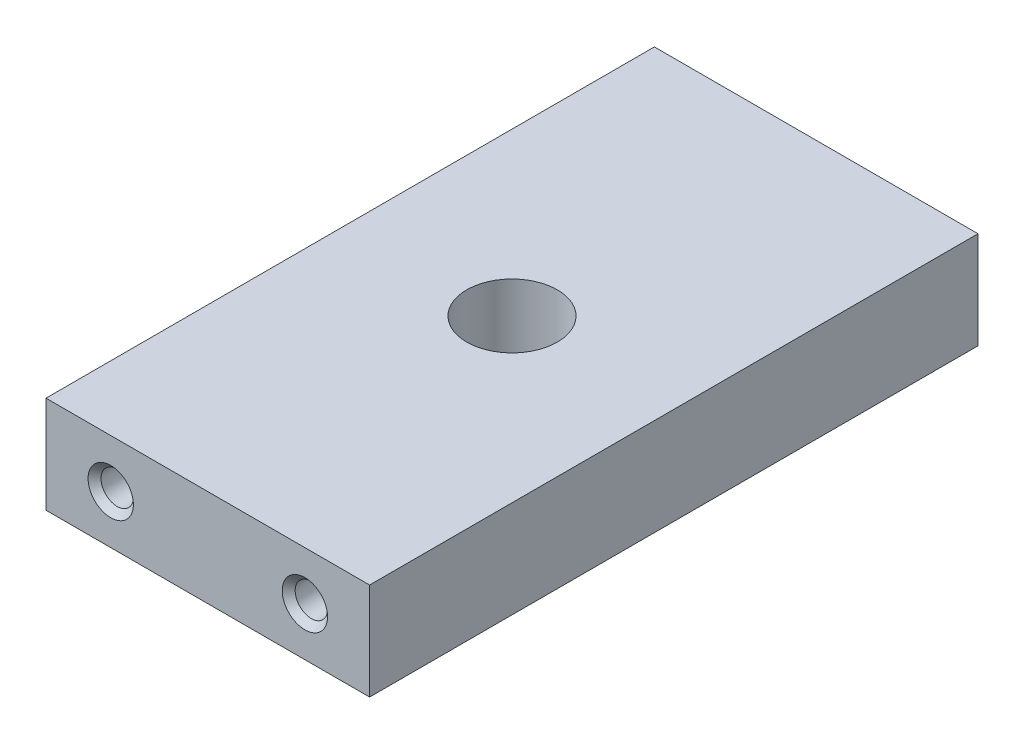
ISO-10303-21;
HEADER;
FILE_DESCRIPTION(('STEP AP214'),'2;1');
FILE_NAME('part.step','',(''),(''),'','','');
FILE_SCHEMA(('AUTOMOTIVE_DESIGN { 1 0 10303 214 1 1 1 1 }'));
ENDSEC;
DATA;
#1=APPLICATION_CONTEXT('core data for automotive mechanical design processes');
#2=APPLICATION_PROTOCOL_DEFINITION('international standard','automotive_design',2000,#1);
#3=PRODUCT_CONTEXT('',#1,'mechanical');
#4=PRODUCT('Part','Part','',(#3));
#5=PRODUCT_RELATED_PRODUCT_CATEGORY('part','',(#4));
#6=PRODUCT_DEFINITION_FORMATION('','',#4);
#7=PRODUCT_DEFINITION_CONTEXT('part definition',#1,'design');
#8=PRODUCT_DEFINITION('design','',#6,#7);
#9=PRODUCT_DEFINITION_SHAPE('','',#8);
#10=(LENGTH_UNIT() NAMED_UNIT(*) SI_UNIT(.MILLI.,.METRE.));
#11=(NAMED_UNIT(*) PLANE_ANGLE_UNIT() SI_UNIT($,.RADIAN.));
#12=(NAMED_UNIT(*) SI_UNIT($,.STERADIAN.) SOLID_ANGLE_UNIT());
#13=UNCERTAINTY_MEASURE_WITH_UNIT(LENGTH_MEASURE(1.E-05),#10,'distance_accuracy_value','');
#14=(GEOMETRIC_REPRESENTATION_CONTEXT(3) GLOBAL_UNCERTAINTY_ASSIGNED_CONTEXT((#13)) GLOBAL_UNIT_ASSIGNED_CONTEXT((#10,
#11,#12)) REPRESENTATION_CONTEXT('',''));
#15=CARTESIAN_POINT('',(0.,0.,0.));
#16=DIRECTION('',(0.,0.,1.));
#17=DIRECTION('',(1.,0.,0.));
#18=AXIS2_PLACEMENT_3D('',#15,#16,#17);
#19=CARTESIAN_POINT('',(0.,0.,47.));
#20=DIRECTION('',(1.,0.,0.));
#21=DIRECTION('',(0.,0.,-1.));
#22=AXIS2_PLACEMENT_3D('',#19,#20,#21);
#23=PLANE('',#22);
#24=DIRECTION('',(0.,-1.,0.));
#25=VECTOR('',#24,1.);
#26=CARTESIAN_POINT('',(0.,0.,0.));
#27=LINE('',#26,#25);
#28=CARTESIAN_POINT('',(0.,15.,0.));
#29=VERTEX_POINT('',#28);
#30=CARTESIAN_POINT('',(0.,0.,0.));
#31=VERTEX_POINT('',#30);
#32=EDGE_CURVE('E116',#29,#31,#27,.T.);
#33=ORIENTED_EDGE('',*,*,#32,.T.);
#34=DIRECTION('',(0.,0.,-1.));
#35=VECTOR('',#34,1.);
#36=CARTESIAN_POINT('',(0.,0.,47.));
#37=LINE('',#36,#35);
#38=CARTESIAN_POINT('',(0.,0.,94.));
#39=VERTEX_POINT('',#38);
#40=EDGE_CURVE('E97',#39,#31,#37,.T.);
#41=ORIENTED_EDGE('',*,*,#40,.F.);
#42=DIRECTION('',(0.,-1.,0.));
#43=VECTOR('',#42,1.);
#44=CARTESIAN_POINT('',(0.,0.,94.));
#45=LINE('',#44,#43);
#46=CARTESIAN_POINT('',(0.,15.,94.));
#47=VERTEX_POINT('',#46);
#48=EDGE_CURVE('E95',#47,#39,#45,.T.);
#49=ORIENTED_EDGE('',*,*,#48,.F.);
#50=DIRECTION('',(0.,0.,-1.));
#51=VECTOR('',#50,1.);
#52=CARTESIAN_POINT('',(0.,15.,47.));
#53=LINE('',#52,#51);
#54=EDGE_CURVE('E83',#47,#29,#53,.T.);
#55=ORIENTED_EDGE('',*,*,#54,.T.);
#56=EDGE_LOOP('',(#33,#41,#49,#55));
#57=FACE_BOUND('',#56,.T.);
#58=ADVANCED_FACE('F42',(#57),#23,.F.);
#59=CARTESIAN_POINT('',(0.,0.,47.));
#60=DIRECTION('',(0.,1.,0.));
#61=DIRECTION('',(0.,0.,1.));
#62=AXIS2_PLACEMENT_3D('',#59,#60,#61);
#63=PLANE('',#62);
#64=CARTESIAN_POINT('',(25.,0.,47.));
#65=DIRECTION('',(0.,1.,0.));
#66=DIRECTION('',(0.,0.,1.));
#67=AXIS2_PLACEMENT_3D('',#64,#65,#66);
#68=CIRCLE('',#67,7.);
#69=CARTESIAN_POINT('',(25.,0.,54.));
#70=VERTEX_POINT('',#69);
#71=EDGE_CURVE('E217',#70,#70,#68,.T.);
#72=ORIENTED_EDGE('',*,*,#71,.T.);
#73=EDGE_LOOP('',(#72));
#74=FACE_BOUND('',#73,.T.);
#75=DIRECTION('',(1.,0.,0.));
#76=VECTOR('',#75,1.);
#77=CARTESIAN_POINT('',(0.,0.,0.));
#78=LINE('',#77,#76);
#79=CARTESIAN_POINT('',(50.,0.,0.));
#80=VERTEX_POINT('',#79);
#81=EDGE_CURVE('E120',#31,#80,#78,.T.);
#82=ORIENTED_EDGE('',*,*,#81,.T.);
#83=DIRECTION('',(0.,0.,-1.));
#84=VECTOR('',#83,1.);
#85=CARTESIAN_POINT('',(50.,0.,47.));
#86=LINE('',#85,#84);
#87=CARTESIAN_POINT('',(50.,0.,94.));
#88=VERTEX_POINT('',#87);
#89=EDGE_CURVE('E125',#88,#80,#86,.T.);
#90=ORIENTED_EDGE('',*,*,#89,.F.);
#91=DIRECTION('',(1.,0.,0.));
#92=VECTOR('',#91,1.);
#93=CARTESIAN_POINT('',(0.,0.,94.));
#94=LINE('',#93,#92);
#95=EDGE_CURVE('E107',#39,#88,#94,.T.);
#96=ORIENTED_EDGE('',*,*,#95,.F.);
#97=ORIENTED_EDGE('',*,*,#40,.T.);
#98=EDGE_LOOP('',(#82,#90,#96,#97));
#99=FACE_BOUND('',#98,.T.);
#100=ADVANCED_FACE('F174',(#74,#99),#63,.F.);
#101=CARTESIAN_POINT('',(50.,0.,47.));
#102=DIRECTION('',(-1.,0.,0.));
#103=DIRECTION('',(0.,0.,1.));
#104=AXIS2_PLACEMENT_3D('',#101,#102,#103);
#105=PLANE('',#104);
#106=DIRECTION('',(0.,1.,0.));
#107=VECTOR('',#106,1.);
#108=CARTESIAN_POINT('',(50.,0.,0.));
#109=LINE('',#108,#107);
#110=CARTESIAN_POINT('',(50.,15.,0.));
#111=VERTEX_POINT('',#110);
#112=EDGE_CURVE('E66',#80,#111,#109,.T.);
#113=ORIENTED_EDGE('',*,*,#112,.T.);
#114=DIRECTION('',(0.,0.,-1.));
#115=VECTOR('',#114,1.);
#116=CARTESIAN_POINT('',(50.,15.,47.));
#117=LINE('',#116,#115);
#118=CARTESIAN_POINT('',(50.,15.,94.));
#119=VERTEX_POINT('',#118);
#120=EDGE_CURVE('E92',#119,#111,#117,.T.);
#121=ORIENTED_EDGE('',*,*,#120,.F.);
#122=DIRECTION('',(0.,1.,0.));
#123=VECTOR('',#122,1.);
#124=CARTESIAN_POINT('',(50.,0.,94.));
#125=LINE('',#124,#123);
#126=EDGE_CURVE('E105',#88,#119,#125,.T.);
#127=ORIENTED_EDGE('',*,*,#126,.F.);
#128=ORIENTED_EDGE('',*,*,#89,.T.);
#129=EDGE_LOOP('',(#113,#121,#127,#128));
#130=FACE_BOUND('',#129,.T.);
#131=ADVANCED_FACE('F179',(#130),#105,.F.);
#132=CARTESIAN_POINT('',(0.,15.,47.));
#133=DIRECTION('',(0.,-1.,0.));
#134=DIRECTION('',(0.,0.,-1.));
#135=AXIS2_PLACEMENT_3D('',#132,#133,#134);
#136=PLANE('',#135);
#137=CARTESIAN_POINT('',(25.,15.,47.));
#138=DIRECTION('',(0.,1.,0.));
#139=DIRECTION('',(0.,0.,1.));
#140=AXIS2_PLACEMENT_3D('',#137,#138,#139);
#141=CIRCLE('',#140,7.);
#142=CARTESIAN_POINT('',(25.,15.,54.));
#143=VERTEX_POINT('',#142);
#144=EDGE_CURVE('E221',#143,#143,#141,.T.);
#145=ORIENTED_EDGE('',*,*,#144,.F.);
#146=EDGE_LOOP('',(#145));
#147=FACE_BOUND('',#146,.T.);
#148=DIRECTION('',(-1.,0.,0.));
#149=VECTOR('',#148,1.);
#150=CARTESIAN_POINT('',(0.,15.,0.));
#151=LINE('',#150,#149);
#152=EDGE_CURVE('E58',#111,#29,#151,.T.);
#153=ORIENTED_EDGE('',*,*,#152,.T.);
#154=ORIENTED_EDGE('',*,*,#54,.F.);
#155=DIRECTION('',(-1.,0.,0.));
#156=VECTOR('',#155,1.);
#157=CARTESIAN_POINT('',(0.,15.,94.));
#158=LINE('',#157,#156);
#159=EDGE_CURVE('E87',#119,#47,#158,.T.);
#160=ORIENTED_EDGE('',*,*,#159,.F.);
#161=ORIENTED_EDGE('',*,*,#120,.T.);
#162=EDGE_LOOP('',(#153,#154,#160,#161));
#163=FACE_BOUND('',#162,.T.);
#164=ADVANCED_FACE('F85',(#147,#163),#136,.F.);
#165=CARTESIAN_POINT('',(0.,0.,0.));
#166=DIRECTION('',(0.,0.,-1.));
#167=DIRECTION('',(-1.,0.,0.));
#168=AXIS2_PLACEMENT_3D('',#165,#166,#167);
#169=PLANE('',#168);
#170=CARTESIAN_POINT('',(40.,7.5,0.));
#171=DIRECTION('',(0.,0.,-1.));
#172=DIRECTION('',(-1.,0.,0.));
#173=AXIS2_PLACEMENT_3D('',#170,#171,#172);
#174=CIRCLE('',#173,3.49999999999999);
#175=CARTESIAN_POINT('',(36.5,7.5,0.));
#176=VERTEX_POINT('',#175);
#177=EDGE_CURVE('E51',#176,#176,#174,.F.);
#178=ORIENTED_EDGE('',*,*,#177,.T.);
#179=EDGE_LOOP('',(#178));
#180=FACE_BOUND('',#179,.T.);
#181=CARTESIAN_POINT('',(10.,7.5,0.));
#182=DIRECTION('',(0.,0.,-1.));
#183=DIRECTION('',(-1.,0.,0.));
#184=AXIS2_PLACEMENT_3D('',#181,#182,#183);
#185=CIRCLE('',#184,3.49999999999999);
#186=CARTESIAN_POINT('',(6.50000000000001,7.5,0.));
#187=VERTEX_POINT('',#186);
#188=EDGE_CURVE('E143',#187,#187,#185,.F.);
#189=ORIENTED_EDGE('',*,*,#188,.T.);
#190=EDGE_LOOP('',(#189));
#191=FACE_BOUND('',#190,.T.);
#192=ORIENTED_EDGE('',*,*,#32,.F.);
#193=ORIENTED_EDGE('',*,*,#152,.F.);
#194=ORIENTED_EDGE('',*,*,#112,.F.);
#195=ORIENTED_EDGE('',*,*,#81,.F.);
#196=EDGE_LOOP('',(#192,#193,#194,#195));
#197=FACE_BOUND('',#196,.T.);
#198=ADVANCED_FACE('F148',(#180,#191,#197),#169,.T.);
#199=CARTESIAN_POINT('',(10.,7.5,20.));
#200=DIRECTION('',(0.,0.,-1.));
#201=DIRECTION('',(-1.,0.,0.));
#202=AXIS2_PLACEMENT_3D('',#199,#200,#201);
#203=CYLINDRICAL_SURFACE('',#202,2.5);
#204=CARTESIAN_POINT('',(10.,7.5,0.999999999999997));
#205=DIRECTION('',(0.,0.,-1.));
#206=DIRECTION('',(-1.,0.,0.));
#207=AXIS2_PLACEMENT_3D('',#204,#205,#206);
#208=CIRCLE('',#207,2.5);
#209=CARTESIAN_POINT('',(7.5,7.5,0.999999999999997));
#210=VERTEX_POINT('',#209);
#211=EDGE_CURVE('E11',#210,#210,#208,.T.);
#212=ORIENTED_EDGE('',*,*,#211,.T.);
#213=EDGE_LOOP('',(#212));
#214=FACE_BOUND('',#213,.T.);
#215=CARTESIAN_POINT('',(10.,7.5,20.));
#216=DIRECTION('',(0.,0.,-1.));
#217=DIRECTION('',(-1.,0.,0.));
#218=AXIS2_PLACEMENT_3D('',#215,#216,#217);
#219=CIRCLE('',#218,2.5);
#220=CARTESIAN_POINT('',(7.5,7.5,20.));
#221=VERTEX_POINT('',#220);
#222=EDGE_CURVE('E112',#221,#221,#219,.T.);
#223=ORIENTED_EDGE('',*,*,#222,.F.);
#224=EDGE_LOOP('',(#223));
#225=FACE_BOUND('',#224,.T.);
#226=ADVANCED_FACE('F234',(#214,#225),#203,.F.);
#227=CARTESIAN_POINT('',(10.,7.5,20.));
#228=DIRECTION('',(0.,0.,-1.));
#229=DIRECTION('',(-1.,0.,0.));
#230=AXIS2_PLACEMENT_3D('',#227,#228,#229);
#231=PLANE('',#230);
#232=ORIENTED_EDGE('',*,*,#222,.T.);
#233=EDGE_LOOP('',(#232));
#234=FACE_BOUND('',#233,.T.);
#235=ADVANCED_FACE('F161',(#234),#231,.T.);
#236=CARTESIAN_POINT('',(40.,7.5,20.));
#237=DIRECTION('',(0.,0.,-1.));
#238=DIRECTION('',(-1.,0.,0.));
#239=AXIS2_PLACEMENT_3D('',#236,#237,#238);
#240=CYLINDRICAL_SURFACE('',#239,2.5);
#241=CARTESIAN_POINT('',(40.,7.5,0.999999999999997));
#242=DIRECTION('',(0.,0.,-1.));
#243=DIRECTION('',(-1.,0.,0.));
#244=AXIS2_PLACEMENT_3D('',#241,#242,#243);
#245=CIRCLE('',#244,2.5);
#246=CARTESIAN_POINT('',(37.5,7.5,0.999999999999997));
#247=VERTEX_POINT('',#246);
#248=EDGE_CURVE('E140',#247,#247,#245,.T.);
#249=ORIENTED_EDGE('',*,*,#248,.T.);
#250=EDGE_LOOP('',(#249));
#251=FACE_BOUND('',#250,.T.);
#252=CARTESIAN_POINT('',(40.,7.5,20.));
#253=DIRECTION('',(0.,0.,-1.));
#254=DIRECTION('',(-1.,0.,0.));
#255=AXIS2_PLACEMENT_3D('',#252,#253,#254);
#256=CIRCLE('',#255,2.5);
#257=CARTESIAN_POINT('',(37.5,7.5,20.));
#258=VERTEX_POINT('',#257);
#259=EDGE_CURVE('E113',#258,#258,#256,.T.);
#260=ORIENTED_EDGE('',*,*,#259,.F.);
#261=EDGE_LOOP('',(#260));
#262=FACE_BOUND('',#261,.T.);
#263=ADVANCED_FACE('F157',(#251,#262),#240,.F.);
#264=CARTESIAN_POINT('',(40.,7.5,20.));
#265=DIRECTION('',(0.,0.,-1.));
#266=DIRECTION('',(-1.,0.,0.));
#267=AXIS2_PLACEMENT_3D('',#264,#265,#266);
#268=PLANE('',#267);
#269=ORIENTED_EDGE('',*,*,#259,.T.);
#270=EDGE_LOOP('',(#269));
#271=FACE_BOUND('',#270,.T.);
#272=ADVANCED_FACE('F160',(#271),#268,.T.);
#273=CARTESIAN_POINT('',(0.,0.,94.));
#274=DIRECTION('',(0.,0.,1.));
#275=DIRECTION('',(-1.,0.,0.));
#276=AXIS2_PLACEMENT_3D('',#273,#274,#275);
#277=PLANE('',#276);
#278=CARTESIAN_POINT('',(40.,7.5,94.));
#279=DIRECTION('',(0.,0.,1.));
#280=DIRECTION('',(1.,0.,0.));
#281=AXIS2_PLACEMENT_3D('',#278,#279,#280);
#282=CIRCLE('',#281,3.5);
#283=CARTESIAN_POINT('',(43.5,7.5,94.));
#284=VERTEX_POINT('',#283);
#285=EDGE_CURVE('E131',#284,#284,#282,.F.);
#286=ORIENTED_EDGE('',*,*,#285,.T.);
#287=EDGE_LOOP('',(#286));
#288=FACE_BOUND('',#287,.T.);
#289=CARTESIAN_POINT('',(10.,7.5,94.));
#290=DIRECTION('',(0.,0.,1.));
#291=DIRECTION('',(1.,0.,0.));
#292=AXIS2_PLACEMENT_3D('',#289,#290,#291);
#293=CIRCLE('',#292,3.5);
#294=CARTESIAN_POINT('',(13.5,7.5,94.));
#295=VERTEX_POINT('',#294);
#296=EDGE_CURVE('E128',#295,#295,#293,.F.);
#297=ORIENTED_EDGE('',*,*,#296,.T.);
#298=EDGE_LOOP('',(#297));
#299=FACE_BOUND('',#298,.T.);
#300=ORIENTED_EDGE('',*,*,#48,.T.);
#301=ORIENTED_EDGE('',*,*,#95,.T.);
#302=ORIENTED_EDGE('',*,*,#126,.T.);
#303=ORIENTED_EDGE('',*,*,#159,.T.);
#304=EDGE_LOOP('',(#300,#301,#302,#303));
#305=FACE_BOUND('',#304,.T.);
#306=ADVANCED_FACE('F103',(#288,#299,#305),#277,.T.);
#307=CARTESIAN_POINT('',(10.,7.5,74.));
#308=DIRECTION('',(0.,0.,1.));
#309=DIRECTION('',(1.,0.,0.));
#310=AXIS2_PLACEMENT_3D('',#307,#308,#309);
#311=CYLINDRICAL_SURFACE('',#310,2.5);
#312=CARTESIAN_POINT('',(10.,7.5,93.));
#313=DIRECTION('',(0.,0.,1.));
#314=DIRECTION('',(1.,0.,0.));
#315=AXIS2_PLACEMENT_3D('',#312,#313,#314);
#316=CIRCLE('',#315,2.5);
#317=CARTESIAN_POINT('',(12.5,7.5,93.));
#318=VERTEX_POINT('',#317);
#319=EDGE_CURVE('E137',#318,#318,#316,.T.);
#320=ORIENTED_EDGE('',*,*,#319,.T.);
#321=EDGE_LOOP('',(#320));
#322=FACE_BOUND('',#321,.T.);
#323=CARTESIAN_POINT('',(10.,7.5,74.));
#324=DIRECTION('',(0.,0.,-1.));
#325=DIRECTION('',(-1.,0.,0.));
#326=AXIS2_PLACEMENT_3D('',#323,#324,#325);
#327=CIRCLE('',#326,2.5);
#328=CARTESIAN_POINT('',(7.5,7.5,74.));
#329=VERTEX_POINT('',#328);
#330=EDGE_CURVE('E215',#329,#329,#327,.T.);
#331=ORIENTED_EDGE('',*,*,#330,.T.);
#332=EDGE_LOOP('',(#331));
#333=FACE_BOUND('',#332,.T.);
#334=ADVANCED_FACE('F170',(#322,#333),#311,.F.);
#335=CARTESIAN_POINT('',(10.,7.5,74.));
#336=DIRECTION('',(0.,0.,1.));
#337=DIRECTION('',(-1.,0.,0.));
#338=AXIS2_PLACEMENT_3D('',#335,#336,#337);
#339=PLANE('',#338);
#340=ORIENTED_EDGE('',*,*,#330,.F.);
#341=EDGE_LOOP('',(#340));
#342=FACE_BOUND('',#341,.T.);
#343=ADVANCED_FACE('F211',(#342),#339,.T.);
#344=CARTESIAN_POINT('',(40.,7.5,74.));
#345=DIRECTION('',(0.,0.,1.));
#346=DIRECTION('',(1.,0.,0.));
#347=AXIS2_PLACEMENT_3D('',#344,#345,#346);
#348=CYLINDRICAL_SURFACE('',#347,2.5);
#349=CARTESIAN_POINT('',(40.,7.5,93.));
#350=DIRECTION('',(0.,0.,1.));
#351=DIRECTION('',(1.,0.,0.));
#352=AXIS2_PLACEMENT_3D('',#349,#350,#351);
#353=CIRCLE('',#352,2.5);
#354=CARTESIAN_POINT('',(42.5,7.5,93.));
#355=VERTEX_POINT('',#354);
#356=EDGE_CURVE('E134',#355,#355,#353,.T.);
#357=ORIENTED_EDGE('',*,*,#356,.T.);
#358=EDGE_LOOP('',(#357));
#359=FACE_BOUND('',#358,.T.);
#360=CARTESIAN_POINT('',(40.,7.5,74.));
#361=DIRECTION('',(0.,0.,-1.));
#362=DIRECTION('',(-1.,0.,0.));
#363=AXIS2_PLACEMENT_3D('',#360,#361,#362);
#364=CIRCLE('',#363,2.5);
#365=CARTESIAN_POINT('',(37.5,7.5,74.));
#366=VERTEX_POINT('',#365);
#367=EDGE_CURVE('E101',#366,#366,#364,.T.);
#368=ORIENTED_EDGE('',*,*,#367,.T.);
#369=EDGE_LOOP('',(#368));
#370=FACE_BOUND('',#369,.T.);
#371=ADVANCED_FACE('F310',(#359,#370),#348,.F.);
#372=CARTESIAN_POINT('',(40.,7.5,74.));
#373=DIRECTION('',(0.,0.,1.));
#374=DIRECTION('',(-1.,0.,0.));
#375=AXIS2_PLACEMENT_3D('',#372,#373,#374);
#376=PLANE('',#375);
#377=ORIENTED_EDGE('',*,*,#367,.F.);
#378=EDGE_LOOP('',(#377));
#379=FACE_BOUND('',#378,.T.);
#380=ADVANCED_FACE('F284',(#379),#376,.T.);
#381=CARTESIAN_POINT('',(25.,0.,47.));
#382=DIRECTION('',(0.,1.,0.));
#383=DIRECTION('',(0.,0.,1.));
#384=AXIS2_PLACEMENT_3D('',#381,#382,#383);
#385=CYLINDRICAL_SURFACE('',#384,7.);
#386=ORIENTED_EDGE('',*,*,#71,.F.);
#387=EDGE_LOOP('',(#386));
#388=FACE_BOUND('',#387,.T.);
#389=ORIENTED_EDGE('',*,*,#144,.T.);
#390=EDGE_LOOP('',(#389));
#391=FACE_BOUND('',#390,.T.);
#392=ADVANCED_FACE('F191',(#388,#391),#385,.F.);
#393=CARTESIAN_POINT('',(40.,7.5,94.));
#394=DIRECTION('',(0.,0.,1.));
#395=DIRECTION('',(1.,0.,0.));
#396=AXIS2_PLACEMENT_3D('',#393,#394,#395);
#397=CONICAL_SURFACE('',#396,3.5,0.785398163397448);
#398=ORIENTED_EDGE('',*,*,#356,.F.);
#399=EDGE_LOOP('',(#398));
#400=FACE_BOUND('',#399,.T.);
#401=ORIENTED_EDGE('',*,*,#285,.F.);
#402=EDGE_LOOP('',(#401));
#403=FACE_BOUND('',#402,.T.);
#404=ADVANCED_FACE('F185',(#400,#403),#397,.F.);
#405=CARTESIAN_POINT('',(10.,7.5,94.));
#406=DIRECTION('',(0.,0.,1.));
#407=DIRECTION('',(1.,0.,0.));
#408=AXIS2_PLACEMENT_3D('',#405,#406,#407);
#409=CONICAL_SURFACE('',#408,3.5,0.785398163397443);
#410=ORIENTED_EDGE('',*,*,#319,.F.);
#411=EDGE_LOOP('',(#410));
#412=FACE_BOUND('',#411,.T.);
#413=ORIENTED_EDGE('',*,*,#296,.F.);
#414=EDGE_LOOP('',(#413));
#415=FACE_BOUND('',#414,.T.);
#416=ADVANCED_FACE('F154',(#412,#415),#409,.F.);
#417=CARTESIAN_POINT('',(40.,7.5,0.999999999999997));
#418=DIRECTION('',(0.,0.,-1.));
#419=DIRECTION('',(-1.,0.,0.));
#420=AXIS2_PLACEMENT_3D('',#417,#418,#419);
#421=CONICAL_SURFACE('',#420,2.5,0.785398163397443);
#422=ORIENTED_EDGE('',*,*,#177,.F.);
#423=EDGE_LOOP('',(#422));
#424=FACE_BOUND('',#423,.T.);
#425=ORIENTED_EDGE('',*,*,#248,.F.);
#426=EDGE_LOOP('',(#425));
#427=FACE_BOUND('',#426,.T.);
#428=ADVANCED_FACE('F151',(#424,#427),#421,.F.);
#429=CARTESIAN_POINT('',(10.,7.5,0.999999999999997));
#430=DIRECTION('',(0.,0.,-1.));
#431=DIRECTION('',(-1.,0.,0.));
#432=AXIS2_PLACEMENT_3D('',#429,#430,#431);
#433=CONICAL_SURFACE('',#432,2.5,0.785398163397444);
#434=ORIENTED_EDGE('',*,*,#188,.F.);
#435=EDGE_LOOP('',(#434));
#436=FACE_BOUND('',#435,.T.);
#437=ORIENTED_EDGE('',*,*,#211,.F.);
#438=EDGE_LOOP('',(#437));
#439=FACE_BOUND('',#438,.T.);
#440=ADVANCED_FACE('F45',(#436,#439),#433,.F.);
#441=CLOSED_SHELL('',(#58,#100,#131,#164,#198,#226,#235,#263,#272,#306,#334,#343,#371,#380,#392,
#404,#416,#428,#440));
#442=MANIFOLD_SOLID_BREP('B2',#441);
#443=ADVANCED_BREP_SHAPE_REPRESENTATION('',(#18,#442),#14);
#444=SHAPE_DEFINITION_REPRESENTATION(#9,#443);
ENDSEC;
END-ISO-10303-21;
